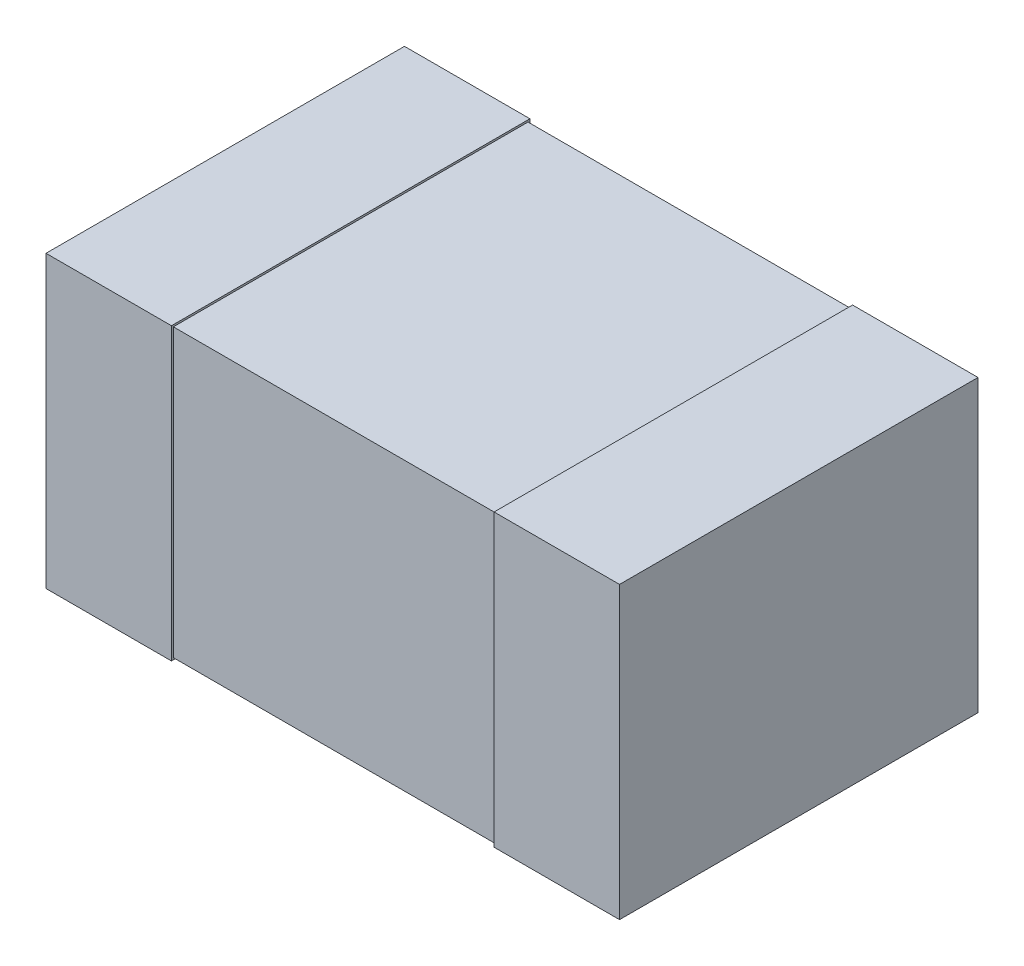
ISO-10303-21;
HEADER;
FILE_DESCRIPTION(('STEP AP214'),'2;1');
FILE_NAME('part.step','',(''),(''),'','','');
FILE_SCHEMA(('AUTOMOTIVE_DESIGN { 1 0 10303 214 1 1 1 1 }'));
ENDSEC;
DATA;
#1=APPLICATION_CONTEXT('core data for automotive mechanical design processes');
#2=APPLICATION_PROTOCOL_DEFINITION('international standard','automotive_design',2000,#1);
#3=PRODUCT_CONTEXT('',#1,'mechanical');
#4=PRODUCT('Part','Part','',(#3));
#5=PRODUCT_RELATED_PRODUCT_CATEGORY('part','',(#4));
#6=PRODUCT_DEFINITION_FORMATION('','',#4);
#7=PRODUCT_DEFINITION_CONTEXT('part definition',#1,'design');
#8=PRODUCT_DEFINITION('design','',#6,#7);
#9=PRODUCT_DEFINITION_SHAPE('','',#8);
#10=(LENGTH_UNIT() NAMED_UNIT(*) SI_UNIT(.MILLI.,.METRE.));
#11=(NAMED_UNIT(*) PLANE_ANGLE_UNIT() SI_UNIT($,.RADIAN.));
#12=(NAMED_UNIT(*) SI_UNIT($,.STERADIAN.) SOLID_ANGLE_UNIT());
#13=UNCERTAINTY_MEASURE_WITH_UNIT(LENGTH_MEASURE(1.E-05),#10,'distance_accuracy_value','');
#14=(GEOMETRIC_REPRESENTATION_CONTEXT(3) GLOBAL_UNCERTAINTY_ASSIGNED_CONTEXT((#13)) GLOBAL_UNIT_ASSIGNED_CONTEXT((#10,
#11,#12)) REPRESENTATION_CONTEXT('',''));
#15=CARTESIAN_POINT('',(0.,0.,0.));
#16=DIRECTION('',(0.,0.,1.));
#17=DIRECTION('',(1.,0.,0.));
#18=AXIS2_PLACEMENT_3D('',#15,#16,#17);
#19=CARTESIAN_POINT('',(0.8,-0.405,0.0762));
#20=DIRECTION('',(1.,0.,0.));
#21=DIRECTION('',(0.,1.,0.));
#22=AXIS2_PLACEMENT_3D('',#19,#20,#21);
#23=PLANE('',#22);
#24=DIRECTION('',(0.,1.,0.));
#25=VECTOR('',#24,1.);
#26=CARTESIAN_POINT('',(0.8,-0.405,0.0762));
#27=LINE('',#26,#25);
#28=CARTESIAN_POINT('',(0.8,-0.405,0.0762));
#29=VERTEX_POINT('',#28);
#30=CARTESIAN_POINT('',(0.8,0.405,0.0762));
#31=VERTEX_POINT('',#30);
#32=EDGE_CURVE('E170',#29,#31,#27,.T.);
#33=ORIENTED_EDGE('',*,*,#32,.T.);
#34=DIRECTION('',(0.,0.,1.));
#35=VECTOR('',#34,1.);
#36=CARTESIAN_POINT('',(0.8,0.405,0.0762));
#37=LINE('',#36,#35);
#38=CARTESIAN_POINT('',(0.8,0.405,1.0762));
#39=VERTEX_POINT('',#38);
#40=EDGE_CURVE('E178',#31,#39,#37,.T.);
#41=ORIENTED_EDGE('',*,*,#40,.T.);
#42=DIRECTION('',(0.,1.,0.));
#43=VECTOR('',#42,1.);
#44=CARTESIAN_POINT('',(0.8,-0.405,1.0762));
#45=LINE('',#44,#43);
#46=CARTESIAN_POINT('',(0.8,-0.405,1.0762));
#47=VERTEX_POINT('',#46);
#48=EDGE_CURVE('E163',#47,#39,#45,.T.);
#49=ORIENTED_EDGE('',*,*,#48,.F.);
#50=DIRECTION('',(0.,0.,1.));
#51=VECTOR('',#50,1.);
#52=CARTESIAN_POINT('',(0.8,-0.405,0.0762));
#53=LINE('',#52,#51);
#54=EDGE_CURVE('E11',#29,#47,#53,.T.);
#55=ORIENTED_EDGE('',*,*,#54,.F.);
#56=EDGE_LOOP('',(#33,#41,#49,#55));
#57=FACE_BOUND('',#56,.T.);
#58=ADVANCED_FACE('F17',(#57),#23,.T.);
#59=CARTESIAN_POINT('',(-0.8,0.405,0.0762));
#60=DIRECTION('',(-1.,0.,0.));
#61=DIRECTION('',(0.,0.,1.));
#62=AXIS2_PLACEMENT_3D('',#59,#60,#61);
#63=PLANE('',#62);
#64=DIRECTION('',(0.,-1.,0.));
#65=VECTOR('',#64,1.);
#66=CARTESIAN_POINT('',(-0.8,0.405,0.0762));
#67=LINE('',#66,#65);
#68=CARTESIAN_POINT('',(-0.8,0.405,0.0762));
#69=VERTEX_POINT('',#68);
#70=CARTESIAN_POINT('',(-0.8,-0.405,0.0762));
#71=VERTEX_POINT('',#70);
#72=EDGE_CURVE('E201',#69,#71,#67,.T.);
#73=ORIENTED_EDGE('',*,*,#72,.T.);
#74=DIRECTION('',(0.,0.,1.));
#75=VECTOR('',#74,1.);
#76=CARTESIAN_POINT('',(-0.8,-0.405,0.0762));
#77=LINE('',#76,#75);
#78=CARTESIAN_POINT('',(-0.8,-0.405,1.0762));
#79=VERTEX_POINT('',#78);
#80=EDGE_CURVE('E28',#71,#79,#77,.T.);
#81=ORIENTED_EDGE('',*,*,#80,.T.);
#82=DIRECTION('',(0.,-1.,0.));
#83=VECTOR('',#82,1.);
#84=CARTESIAN_POINT('',(-0.8,0.405,1.0762));
#85=LINE('',#84,#83);
#86=CARTESIAN_POINT('',(-0.8,0.405,1.0762));
#87=VERTEX_POINT('',#86);
#88=EDGE_CURVE('E115',#87,#79,#85,.T.);
#89=ORIENTED_EDGE('',*,*,#88,.F.);
#90=DIRECTION('',(0.,0.,1.));
#91=VECTOR('',#90,1.);
#92=CARTESIAN_POINT('',(-0.8,0.405,0.0762));
#93=LINE('',#92,#91);
#94=EDGE_CURVE('E76',#69,#87,#93,.T.);
#95=ORIENTED_EDGE('',*,*,#94,.F.);
#96=EDGE_LOOP('',(#73,#81,#89,#95));
#97=FACE_BOUND('',#96,.T.);
#98=ADVANCED_FACE('F504',(#97),#63,.T.);
#99=CARTESIAN_POINT('',(-0.8,-0.405,0.0762));
#100=DIRECTION('',(0.,-1.,0.));
#101=DIRECTION('',(0.,0.,-1.));
#102=AXIS2_PLACEMENT_3D('',#99,#100,#101);
#103=PLANE('',#102);
#104=DIRECTION('',(0.,0.,1.));
#105=VECTOR('',#104,1.);
#106=CARTESIAN_POINT('',(0.45,-0.405,0.0762));
#107=LINE('',#106,#105);
#108=CARTESIAN_POINT('',(0.45,-0.405,0.0762));
#109=VERTEX_POINT('',#108);
#110=CARTESIAN_POINT('',(0.45,-0.405,1.0762));
#111=VERTEX_POINT('',#110);
#112=EDGE_CURVE('E60',#109,#111,#107,.T.);
#113=ORIENTED_EDGE('',*,*,#112,.F.);
#114=DIRECTION('',(1.,0.,0.));
#115=VECTOR('',#114,1.);
#116=CARTESIAN_POINT('',(0.45,-0.405,0.0762));
#117=LINE('',#116,#115);
#118=EDGE_CURVE('E142',#109,#29,#117,.T.);
#119=ORIENTED_EDGE('',*,*,#118,.T.);
#120=ORIENTED_EDGE('',*,*,#54,.T.);
#121=DIRECTION('',(1.,0.,0.));
#122=VECTOR('',#121,1.);
#123=CARTESIAN_POINT('',(0.45,-0.405,1.0762));
#124=LINE('',#123,#122);
#125=EDGE_CURVE('E118',#111,#47,#124,.T.);
#126=ORIENTED_EDGE('',*,*,#125,.F.);
#127=EDGE_LOOP('',(#113,#119,#120,#126));
#128=FACE_BOUND('',#127,.T.);
#129=ADVANCED_FACE('F302',(#128),#103,.T.);
#130=CARTESIAN_POINT('',(-0.8,-0.405,0.0762));
#131=DIRECTION('',(0.,-1.,0.));
#132=DIRECTION('',(0.,0.,-1.));
#133=AXIS2_PLACEMENT_3D('',#130,#131,#132);
#134=PLANE('',#133);
#135=DIRECTION('',(0.,0.,1.));
#136=VECTOR('',#135,1.);
#137=CARTESIAN_POINT('',(-0.45,-0.405,0.0762));
#138=LINE('',#137,#136);
#139=CARTESIAN_POINT('',(-0.45,-0.405,0.0762));
#140=VERTEX_POINT('',#139);
#141=CARTESIAN_POINT('',(-0.45,-0.405,1.0762));
#142=VERTEX_POINT('',#141);
#143=EDGE_CURVE('E122',#140,#142,#138,.T.);
#144=ORIENTED_EDGE('',*,*,#143,.T.);
#145=DIRECTION('',(1.,0.,0.));
#146=VECTOR('',#145,1.);
#147=CARTESIAN_POINT('',(-0.8,-0.405,1.0762));
#148=LINE('',#147,#146);
#149=EDGE_CURVE('E108',#79,#142,#148,.T.);
#150=ORIENTED_EDGE('',*,*,#149,.F.);
#151=ORIENTED_EDGE('',*,*,#80,.F.);
#152=DIRECTION('',(1.,0.,0.));
#153=VECTOR('',#152,1.);
#154=CARTESIAN_POINT('',(-0.8,-0.405,0.0762));
#155=LINE('',#154,#153);
#156=EDGE_CURVE('E126',#71,#140,#155,.T.);
#157=ORIENTED_EDGE('',*,*,#156,.T.);
#158=EDGE_LOOP('',(#144,#150,#151,#157));
#159=FACE_BOUND('',#158,.T.);
#160=ADVANCED_FACE('F123',(#159),#134,.T.);
#161=CARTESIAN_POINT('',(0.,0.,1.0762));
#162=DIRECTION('',(0.,0.,1.));
#163=DIRECTION('',(1.,0.,0.));
#164=AXIS2_PLACEMENT_3D('',#161,#162,#163);
#165=PLANE('',#164);
#166=DIRECTION('',(0.,1.,0.));
#167=VECTOR('',#166,1.);
#168=CARTESIAN_POINT('',(0.45,-0.405,1.0762));
#169=LINE('',#168,#167);
#170=CARTESIAN_POINT('',(0.45,0.405,1.0762));
#171=VERTEX_POINT('',#170);
#172=EDGE_CURVE('E226',#111,#171,#169,.T.);
#173=ORIENTED_EDGE('',*,*,#172,.F.);
#174=ORIENTED_EDGE('',*,*,#125,.T.);
#175=ORIENTED_EDGE('',*,*,#48,.T.);
#176=DIRECTION('',(-1.,0.,0.));
#177=VECTOR('',#176,1.);
#178=CARTESIAN_POINT('',(0.8,0.405,1.0762));
#179=LINE('',#178,#177);
#180=EDGE_CURVE('E174',#39,#171,#179,.T.);
#181=ORIENTED_EDGE('',*,*,#180,.T.);
#182=EDGE_LOOP('',(#173,#174,#175,#181));
#183=FACE_BOUND('',#182,.T.);
#184=ADVANCED_FACE('F479',(#183),#165,.T.);
#185=CARTESIAN_POINT('',(0.,0.,1.0762));
#186=DIRECTION('',(0.,0.,1.));
#187=DIRECTION('',(1.,0.,0.));
#188=AXIS2_PLACEMENT_3D('',#185,#186,#187);
#189=PLANE('',#188);
#190=DIRECTION('',(0.,1.,0.));
#191=VECTOR('',#190,1.);
#192=CARTESIAN_POINT('',(-0.45,-0.405,1.0762));
#193=LINE('',#192,#191);
#194=CARTESIAN_POINT('',(-0.45,0.405,1.0762));
#195=VERTEX_POINT('',#194);
#196=EDGE_CURVE('E113',#142,#195,#193,.T.);
#197=ORIENTED_EDGE('',*,*,#196,.T.);
#198=DIRECTION('',(-1.,0.,0.));
#199=VECTOR('',#198,1.);
#200=CARTESIAN_POINT('',(-0.45,0.405,1.0762));
#201=LINE('',#200,#199);
#202=EDGE_CURVE('E179',#195,#87,#201,.T.);
#203=ORIENTED_EDGE('',*,*,#202,.T.);
#204=ORIENTED_EDGE('',*,*,#88,.T.);
#205=ORIENTED_EDGE('',*,*,#149,.T.);
#206=EDGE_LOOP('',(#197,#203,#204,#205));
#207=FACE_BOUND('',#206,.T.);
#208=ADVANCED_FACE('F110',(#207),#189,.T.);
#209=CARTESIAN_POINT('',(0.8,0.405,0.0762));
#210=DIRECTION('',(0.,1.,0.));
#211=DIRECTION('',(1.,0.,0.));
#212=AXIS2_PLACEMENT_3D('',#209,#210,#211);
#213=PLANE('',#212);
#214=DIRECTION('',(0.,0.,1.));
#215=VECTOR('',#214,1.);
#216=CARTESIAN_POINT('',(0.45,0.405,0.0762));
#217=LINE('',#216,#215);
#218=CARTESIAN_POINT('',(0.45,0.405,0.0762));
#219=VERTEX_POINT('',#218);
#220=EDGE_CURVE('E184',#219,#171,#217,.T.);
#221=ORIENTED_EDGE('',*,*,#220,.T.);
#222=ORIENTED_EDGE('',*,*,#180,.F.);
#223=ORIENTED_EDGE('',*,*,#40,.F.);
#224=DIRECTION('',(-1.,0.,0.));
#225=VECTOR('',#224,1.);
#226=CARTESIAN_POINT('',(0.8,0.405,0.0762));
#227=LINE('',#226,#225);
#228=EDGE_CURVE('E21',#31,#219,#227,.T.);
#229=ORIENTED_EDGE('',*,*,#228,.T.);
#230=EDGE_LOOP('',(#221,#222,#223,#229));
#231=FACE_BOUND('',#230,.T.);
#232=ADVANCED_FACE('F19',(#231),#213,.T.);
#233=CARTESIAN_POINT('',(0.8,0.405,0.0762));
#234=DIRECTION('',(0.,1.,0.));
#235=DIRECTION('',(1.,0.,0.));
#236=AXIS2_PLACEMENT_3D('',#233,#234,#235);
#237=PLANE('',#236);
#238=DIRECTION('',(0.,0.,1.));
#239=VECTOR('',#238,1.);
#240=CARTESIAN_POINT('',(-0.45,0.405,0.0762));
#241=LINE('',#240,#239);
#242=CARTESIAN_POINT('',(-0.45,0.405,0.0762));
#243=VERTEX_POINT('',#242);
#244=EDGE_CURVE('E135',#243,#195,#241,.T.);
#245=ORIENTED_EDGE('',*,*,#244,.F.);
#246=DIRECTION('',(-1.,0.,0.));
#247=VECTOR('',#246,1.);
#248=CARTESIAN_POINT('',(-0.45,0.405,0.0762));
#249=LINE('',#248,#247);
#250=EDGE_CURVE('E158',#243,#69,#249,.T.);
#251=ORIENTED_EDGE('',*,*,#250,.T.);
#252=ORIENTED_EDGE('',*,*,#94,.T.);
#253=ORIENTED_EDGE('',*,*,#202,.F.);
#254=EDGE_LOOP('',(#245,#251,#252,#253));
#255=FACE_BOUND('',#254,.T.);
#256=ADVANCED_FACE('F452',(#255),#237,.T.);
#257=CARTESIAN_POINT('',(0.45,-0.405,0.081534));
#258=DIRECTION('',(1.,0.,0.));
#259=DIRECTION('',(0.,1.,0.));
#260=AXIS2_PLACEMENT_3D('',#257,#258,#259);
#261=PLANE('',#260);
#262=DIRECTION('',(0.,1.,0.));
#263=VECTOR('',#262,1.);
#264=CARTESIAN_POINT('',(0.45,-0.399666,0.081534));
#265=LINE('',#264,#263);
#266=CARTESIAN_POINT('',(0.45,-0.399666,0.081534));
#267=VERTEX_POINT('',#266);
#268=CARTESIAN_POINT('',(0.45,0.399666,0.081534));
#269=VERTEX_POINT('',#268);
#270=EDGE_CURVE('E187',#267,#269,#265,.T.);
#271=ORIENTED_EDGE('',*,*,#270,.T.);
#272=DIRECTION('',(0.,0.,1.));
#273=VECTOR('',#272,1.);
#274=CARTESIAN_POINT('',(0.45,0.399666,0.081534));
#275=LINE('',#274,#273);
#276=CARTESIAN_POINT('',(0.45,0.399666,1.070866));
#277=VERTEX_POINT('',#276);
#278=EDGE_CURVE('E191',#269,#277,#275,.T.);
#279=ORIENTED_EDGE('',*,*,#278,.T.);
#280=DIRECTION('',(0.,-1.,0.));
#281=VECTOR('',#280,1.);
#282=CARTESIAN_POINT('',(0.45,0.399666,1.070866));
#283=LINE('',#282,#281);
#284=CARTESIAN_POINT('',(0.45,-0.399666,1.070866));
#285=VERTEX_POINT('',#284);
#286=EDGE_CURVE('E220',#277,#285,#283,.T.);
#287=ORIENTED_EDGE('',*,*,#286,.T.);
#288=DIRECTION('',(0.,0.,-1.));
#289=VECTOR('',#288,1.);
#290=CARTESIAN_POINT('',(0.45,-0.399666,1.070866));
#291=LINE('',#290,#289);
#292=EDGE_CURVE('E211',#285,#267,#291,.T.);
#293=ORIENTED_EDGE('',*,*,#292,.T.);
#294=EDGE_LOOP('',(#271,#279,#287,#293));
#295=FACE_BOUND('',#294,.T.);
#296=DIRECTION('',(0.,1.,0.));
#297=VECTOR('',#296,1.);
#298=CARTESIAN_POINT('',(0.45,-0.405,0.0762));
#299=LINE('',#298,#297);
#300=EDGE_CURVE('E154',#109,#219,#299,.T.);
#301=ORIENTED_EDGE('',*,*,#300,.F.);
#302=ORIENTED_EDGE('',*,*,#112,.T.);
#303=ORIENTED_EDGE('',*,*,#172,.T.);
#304=ORIENTED_EDGE('',*,*,#220,.F.);
#305=EDGE_LOOP('',(#301,#302,#303,#304));
#306=FACE_BOUND('',#305,.T.);
#307=ADVANCED_FACE('F250',(#295,#306),#261,.F.);
#308=CARTESIAN_POINT('',(-0.45,-0.405,0.081534));
#309=DIRECTION('',(0.,0.,1.));
#310=DIRECTION('',(1.,0.,0.));
#311=AXIS2_PLACEMENT_3D('',#308,#309,#310);
#312=PLANE('',#311);
#313=DIRECTION('',(1.,0.,0.));
#314=VECTOR('',#313,1.);
#315=CARTESIAN_POINT('',(-0.45,-0.399666,0.081534));
#316=LINE('',#315,#314);
#317=CARTESIAN_POINT('',(-0.45,-0.399666,0.081534));
#318=VERTEX_POINT('',#317);
#319=EDGE_CURVE('E198',#318,#267,#316,.T.);
#320=ORIENTED_EDGE('',*,*,#319,.F.);
#321=DIRECTION('',(0.,1.,0.));
#322=VECTOR('',#321,1.);
#323=CARTESIAN_POINT('',(-0.45,-0.399666,0.081534));
#324=LINE('',#323,#322);
#325=CARTESIAN_POINT('',(-0.45,0.399666,0.081534));
#326=VERTEX_POINT('',#325);
#327=EDGE_CURVE('E153',#318,#326,#324,.T.);
#328=ORIENTED_EDGE('',*,*,#327,.T.);
#329=DIRECTION('',(1.,0.,0.));
#330=VECTOR('',#329,1.);
#331=CARTESIAN_POINT('',(-0.45,0.399666,0.081534));
#332=LINE('',#331,#330);
#333=EDGE_CURVE('E216',#326,#269,#332,.T.);
#334=ORIENTED_EDGE('',*,*,#333,.T.);
#335=ORIENTED_EDGE('',*,*,#270,.F.);
#336=EDGE_LOOP('',(#320,#328,#334,#335));
#337=FACE_BOUND('',#336,.T.);
#338=ADVANCED_FACE('F451',(#337),#312,.F.);
#339=CARTESIAN_POINT('',(-0.45,0.399666,0.0762));
#340=DIRECTION('',(0.,-1.,0.));
#341=DIRECTION('',(0.,0.,-1.));
#342=AXIS2_PLACEMENT_3D('',#339,#340,#341);
#343=PLANE('',#342);
#344=ORIENTED_EDGE('',*,*,#333,.F.);
#345=DIRECTION('',(0.,0.,1.));
#346=VECTOR('',#345,1.);
#347=CARTESIAN_POINT('',(-0.45,0.399666,0.081534));
#348=LINE('',#347,#346);
#349=CARTESIAN_POINT('',(-0.45,0.399666,1.070866));
#350=VERTEX_POINT('',#349);
#351=EDGE_CURVE('E149',#326,#350,#348,.T.);
#352=ORIENTED_EDGE('',*,*,#351,.T.);
#353=DIRECTION('',(1.,0.,0.));
#354=VECTOR('',#353,1.);
#355=CARTESIAN_POINT('',(-0.45,0.399666,1.070866));
#356=LINE('',#355,#354);
#357=EDGE_CURVE('E215',#350,#277,#356,.T.);
#358=ORIENTED_EDGE('',*,*,#357,.T.);
#359=ORIENTED_EDGE('',*,*,#278,.F.);
#360=EDGE_LOOP('',(#344,#352,#358,#359));
#361=FACE_BOUND('',#360,.T.);
#362=ADVANCED_FACE('F526',(#361),#343,.F.);
#363=CARTESIAN_POINT('',(-0.45,0.405,1.070866));
#364=DIRECTION('',(0.,0.,-1.));
#365=DIRECTION('',(0.,-1.,0.));
#366=AXIS2_PLACEMENT_3D('',#363,#364,#365);
#367=PLANE('',#366);
#368=ORIENTED_EDGE('',*,*,#357,.F.);
#369=DIRECTION('',(0.,-1.,0.));
#370=VECTOR('',#369,1.);
#371=CARTESIAN_POINT('',(-0.45,0.399666,1.070866));
#372=LINE('',#371,#370);
#373=CARTESIAN_POINT('',(-0.45,-0.399666,1.070866));
#374=VERTEX_POINT('',#373);
#375=EDGE_CURVE('E148',#350,#374,#372,.T.);
#376=ORIENTED_EDGE('',*,*,#375,.T.);
#377=DIRECTION('',(1.,0.,0.));
#378=VECTOR('',#377,1.);
#379=CARTESIAN_POINT('',(-0.45,-0.399666,1.070866));
#380=LINE('',#379,#378);
#381=EDGE_CURVE('E162',#374,#285,#380,.T.);
#382=ORIENTED_EDGE('',*,*,#381,.T.);
#383=ORIENTED_EDGE('',*,*,#286,.F.);
#384=EDGE_LOOP('',(#368,#376,#382,#383));
#385=FACE_BOUND('',#384,.T.);
#386=ADVANCED_FACE('F258',(#385),#367,.F.);
#387=CARTESIAN_POINT('',(-0.45,-0.399666,1.0762));
#388=DIRECTION('',(0.,1.,0.));
#389=DIRECTION('',(1.,0.,0.));
#390=AXIS2_PLACEMENT_3D('',#387,#388,#389);
#391=PLANE('',#390);
#392=ORIENTED_EDGE('',*,*,#381,.F.);
#393=DIRECTION('',(0.,0.,-1.));
#394=VECTOR('',#393,1.);
#395=CARTESIAN_POINT('',(-0.45,-0.399666,1.070866));
#396=LINE('',#395,#394);
#397=EDGE_CURVE('E131',#374,#318,#396,.T.);
#398=ORIENTED_EDGE('',*,*,#397,.T.);
#399=ORIENTED_EDGE('',*,*,#319,.T.);
#400=ORIENTED_EDGE('',*,*,#292,.F.);
#401=EDGE_LOOP('',(#392,#398,#399,#400));
#402=FACE_BOUND('',#401,.T.);
#403=ADVANCED_FACE('F256',(#402),#391,.F.);
#404=CARTESIAN_POINT('',(-0.45,-0.405,0.0762));
#405=DIRECTION('',(-1.,0.,0.));
#406=DIRECTION('',(0.,0.,1.));
#407=AXIS2_PLACEMENT_3D('',#404,#405,#406);
#408=PLANE('',#407);
#409=ORIENTED_EDGE('',*,*,#397,.F.);
#410=ORIENTED_EDGE('',*,*,#375,.F.);
#411=ORIENTED_EDGE('',*,*,#351,.F.);
#412=ORIENTED_EDGE('',*,*,#327,.F.);
#413=EDGE_LOOP('',(#409,#410,#411,#412));
#414=FACE_BOUND('',#413,.T.);
#415=DIRECTION('',(0.,1.,0.));
#416=VECTOR('',#415,1.);
#417=CARTESIAN_POINT('',(-0.45,-0.405,0.0762));
#418=LINE('',#417,#416);
#419=EDGE_CURVE('E192',#140,#243,#418,.T.);
#420=ORIENTED_EDGE('',*,*,#419,.T.);
#421=ORIENTED_EDGE('',*,*,#244,.T.);
#422=ORIENTED_EDGE('',*,*,#196,.F.);
#423=ORIENTED_EDGE('',*,*,#143,.F.);
#424=EDGE_LOOP('',(#420,#421,#422,#423));
#425=FACE_BOUND('',#424,.T.);
#426=ADVANCED_FACE('F133',(#414,#425),#408,.F.);
#427=CARTESIAN_POINT('',(0.,0.,0.0762));
#428=DIRECTION('',(0.,0.,1.));
#429=DIRECTION('',(1.,0.,0.));
#430=AXIS2_PLACEMENT_3D('',#427,#428,#429);
#431=PLANE('',#430);
#432=ORIENTED_EDGE('',*,*,#300,.T.);
#433=ORIENTED_EDGE('',*,*,#228,.F.);
#434=ORIENTED_EDGE('',*,*,#32,.F.);
#435=ORIENTED_EDGE('',*,*,#118,.F.);
#436=EDGE_LOOP('',(#432,#433,#434,#435));
#437=FACE_BOUND('',#436,.T.);
#438=ADVANCED_FACE('F305',(#437),#431,.F.);
#439=CARTESIAN_POINT('',(0.,0.,0.0762));
#440=DIRECTION('',(0.,0.,1.));
#441=DIRECTION('',(1.,0.,0.));
#442=AXIS2_PLACEMENT_3D('',#439,#440,#441);
#443=PLANE('',#442);
#444=ORIENTED_EDGE('',*,*,#419,.F.);
#445=ORIENTED_EDGE('',*,*,#156,.F.);
#446=ORIENTED_EDGE('',*,*,#72,.F.);
#447=ORIENTED_EDGE('',*,*,#250,.F.);
#448=EDGE_LOOP('',(#444,#445,#446,#447));
#449=FACE_BOUND('',#448,.T.);
#450=ADVANCED_FACE('F368',(#449),#443,.F.);
#451=CLOSED_SHELL('',(#58,#98,#129,#160,#184,#208,#232,#256,#307,#338,#362,#386,#403,#426,#438,#450));
#452=MANIFOLD_SOLID_BREP('B1',#451);
#453=ADVANCED_BREP_SHAPE_REPRESENTATION('',(#18,#452),#14);
#454=SHAPE_DEFINITION_REPRESENTATION(#9,#453);
ENDSEC;
END-ISO-10303-21;
